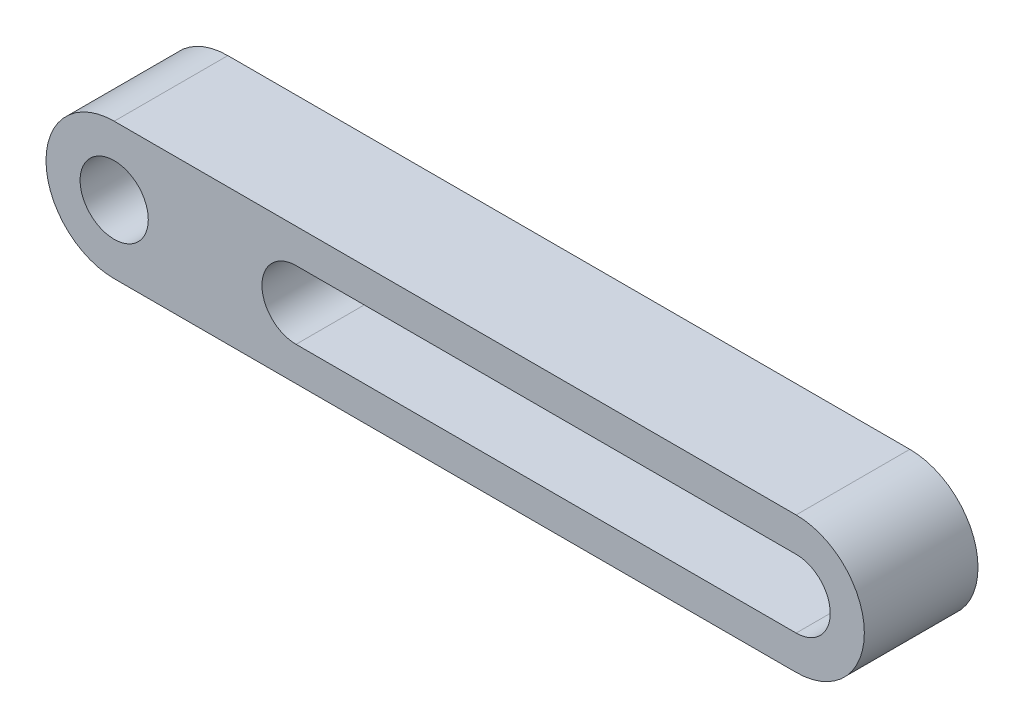
ISO-10303-21;
HEADER;
FILE_DESCRIPTION(('STEP AP214'),'2;1');
FILE_NAME('part.step','',(''),(''),'','','');
FILE_SCHEMA(('AUTOMOTIVE_DESIGN { 1 0 10303 214 1 1 1 1 }'));
ENDSEC;
DATA;
#1=APPLICATION_CONTEXT('core data for automotive mechanical design processes');
#2=APPLICATION_PROTOCOL_DEFINITION('international standard','automotive_design',2000,#1);
#3=PRODUCT_CONTEXT('',#1,'mechanical');
#4=PRODUCT('Part','Part','',(#3));
#5=PRODUCT_RELATED_PRODUCT_CATEGORY('part','',(#4));
#6=PRODUCT_DEFINITION_FORMATION('','',#4);
#7=PRODUCT_DEFINITION_CONTEXT('part definition',#1,'design');
#8=PRODUCT_DEFINITION('design','',#6,#7);
#9=PRODUCT_DEFINITION_SHAPE('','',#8);
#10=(LENGTH_UNIT() NAMED_UNIT(*) SI_UNIT(.MILLI.,.METRE.));
#11=(NAMED_UNIT(*) PLANE_ANGLE_UNIT() SI_UNIT($,.RADIAN.));
#12=(NAMED_UNIT(*) SI_UNIT($,.STERADIAN.) SOLID_ANGLE_UNIT());
#13=UNCERTAINTY_MEASURE_WITH_UNIT(LENGTH_MEASURE(1.E-05),#10,'distance_accuracy_value','');
#14=(GEOMETRIC_REPRESENTATION_CONTEXT(3) GLOBAL_UNCERTAINTY_ASSIGNED_CONTEXT((#13)) GLOBAL_UNIT_ASSIGNED_CONTEXT((#10,
#11,#12)) REPRESENTATION_CONTEXT('',''));
#15=CARTESIAN_POINT('',(0.,0.,0.));
#16=DIRECTION('',(0.,0.,1.));
#17=DIRECTION('',(1.,0.,0.));
#18=AXIS2_PLACEMENT_3D('',#15,#16,#17);
#19=CARTESIAN_POINT('',(0.,0.,5.));
#20=DIRECTION('',(0.,0.,1.));
#21=DIRECTION('',(1.,0.,0.));
#22=AXIS2_PLACEMENT_3D('',#19,#20,#21);
#23=PLANE('',#22);
#24=CARTESIAN_POINT('',(0.,0.,5.));
#25=DIRECTION('',(0.,0.,1.));
#26=DIRECTION('',(1.,0.,0.));
#27=AXIS2_PLACEMENT_3D('',#24,#25,#26);
#28=CIRCLE('',#27,3.00000000000011);
#29=CARTESIAN_POINT('',(0.,3.00000000000011,5.));
#30=VERTEX_POINT('',#29);
#31=CARTESIAN_POINT('',(0.,-3.00000000000011,5.));
#32=VERTEX_POINT('',#31);
#33=EDGE_CURVE('E150',#30,#32,#28,.T.);
#34=ORIENTED_EDGE('',*,*,#33,.T.);
#35=DIRECTION('',(1.,0.,0.));
#36=VECTOR('',#35,1.);
#37=CARTESIAN_POINT('',(0.,-3.00000000000011,5.));
#38=LINE('',#37,#36);
#39=CARTESIAN_POINT('',(30.,-3.,5.));
#40=VERTEX_POINT('',#39);
#41=EDGE_CURVE('E153',#32,#40,#38,.T.);
#42=ORIENTED_EDGE('',*,*,#41,.T.);
#43=CARTESIAN_POINT('',(30.,0.,5.));
#44=DIRECTION('',(0.,0.,1.));
#45=DIRECTION('',(1.,0.,0.));
#46=AXIS2_PLACEMENT_3D('',#43,#44,#45);
#47=CIRCLE('',#46,3.);
#48=CARTESIAN_POINT('',(30.,3.,5.));
#49=VERTEX_POINT('',#48);
#50=EDGE_CURVE('E156',#40,#49,#47,.T.);
#51=ORIENTED_EDGE('',*,*,#50,.T.);
#52=DIRECTION('',(-1.,0.,0.));
#53=VECTOR('',#52,1.);
#54=CARTESIAN_POINT('',(0.,3.00000000000011,5.));
#55=LINE('',#54,#53);
#56=EDGE_CURVE('E158',#49,#30,#55,.T.);
#57=ORIENTED_EDGE('',*,*,#56,.T.);
#58=EDGE_LOOP('',(#34,#42,#51,#57));
#59=FACE_BOUND('',#58,.T.);
#60=CARTESIAN_POINT('',(0.,0.,5.));
#61=DIRECTION('',(0.,0.,1.));
#62=DIRECTION('',(1.,0.,0.));
#63=AXIS2_PLACEMENT_3D('',#60,#61,#62);
#64=CIRCLE('',#63,1.50000000000006);
#65=CARTESIAN_POINT('',(1.50000000000006,0.,5.));
#66=VERTEX_POINT('',#65);
#67=EDGE_CURVE('E144',#66,#66,#64,.T.);
#68=ORIENTED_EDGE('',*,*,#67,.F.);
#69=EDGE_LOOP('',(#68));
#70=FACE_BOUND('',#69,.T.);
#71=DIRECTION('',(-1.,0.,0.));
#72=VECTOR('',#71,1.);
#73=CARTESIAN_POINT('',(30.,1.5,5.));
#74=LINE('',#73,#72);
#75=CARTESIAN_POINT('',(30.,1.5,5.));
#76=VERTEX_POINT('',#75);
#77=CARTESIAN_POINT('',(8.,1.5,5.));
#78=VERTEX_POINT('',#77);
#79=EDGE_CURVE('E116',#76,#78,#74,.T.);
#80=ORIENTED_EDGE('',*,*,#79,.F.);
#81=CARTESIAN_POINT('',(30.,0.,5.));
#82=DIRECTION('',(0.,0.,1.));
#83=DIRECTION('',(1.,0.,0.));
#84=AXIS2_PLACEMENT_3D('',#81,#82,#83);
#85=CIRCLE('',#84,1.5);
#86=CARTESIAN_POINT('',(30.,-1.5,5.));
#87=VERTEX_POINT('',#86);
#88=EDGE_CURVE('E108',#87,#76,#85,.T.);
#89=ORIENTED_EDGE('',*,*,#88,.F.);
#90=DIRECTION('',(1.,0.,0.));
#91=VECTOR('',#90,1.);
#92=CARTESIAN_POINT('',(30.,-1.5,5.));
#93=LINE('',#92,#91);
#94=CARTESIAN_POINT('',(8.,-1.5,5.));
#95=VERTEX_POINT('',#94);
#96=EDGE_CURVE('E130',#95,#87,#93,.T.);
#97=ORIENTED_EDGE('',*,*,#96,.F.);
#98=CARTESIAN_POINT('',(8.,0.,5.));
#99=DIRECTION('',(0.,0.,1.));
#100=DIRECTION('',(1.,0.,0.));
#101=AXIS2_PLACEMENT_3D('',#98,#99,#100);
#102=CIRCLE('',#101,1.5);
#103=EDGE_CURVE('E128',#78,#95,#102,.T.);
#104=ORIENTED_EDGE('',*,*,#103,.F.);
#105=EDGE_LOOP('',(#80,#89,#97,#104));
#106=FACE_BOUND('',#105,.T.);
#107=ADVANCED_FACE('F43',(#59,#70,#106),#23,.T.);
#108=CARTESIAN_POINT('',(0.,0.,0.));
#109=DIRECTION('',(0.,0.,1.));
#110=DIRECTION('',(1.,0.,0.));
#111=AXIS2_PLACEMENT_3D('',#108,#109,#110);
#112=PLANE('',#111);
#113=CARTESIAN_POINT('',(0.,0.,0.));
#114=DIRECTION('',(0.,0.,1.));
#115=DIRECTION('',(1.,0.,0.));
#116=AXIS2_PLACEMENT_3D('',#113,#114,#115);
#117=CIRCLE('',#116,1.50000000000006);
#118=CARTESIAN_POINT('',(1.50000000000006,0.,0.));
#119=VERTEX_POINT('',#118);
#120=EDGE_CURVE('E124',#119,#119,#117,.T.);
#121=ORIENTED_EDGE('',*,*,#120,.T.);
#122=EDGE_LOOP('',(#121));
#123=FACE_BOUND('',#122,.T.);
#124=CARTESIAN_POINT('',(0.,0.,0.));
#125=DIRECTION('',(0.,0.,1.));
#126=DIRECTION('',(1.,0.,0.));
#127=AXIS2_PLACEMENT_3D('',#124,#125,#126);
#128=CIRCLE('',#127,3.00000000000011);
#129=CARTESIAN_POINT('',(0.,3.00000000000011,0.));
#130=VERTEX_POINT('',#129);
#131=CARTESIAN_POINT('',(0.,-3.00000000000011,0.));
#132=VERTEX_POINT('',#131);
#133=EDGE_CURVE('E147',#130,#132,#128,.T.);
#134=ORIENTED_EDGE('',*,*,#133,.F.);
#135=DIRECTION('',(-1.,0.,0.));
#136=VECTOR('',#135,1.);
#137=CARTESIAN_POINT('',(0.,3.00000000000011,0.));
#138=LINE('',#137,#136);
#139=CARTESIAN_POINT('',(30.,3.,0.));
#140=VERTEX_POINT('',#139);
#141=EDGE_CURVE('E154',#140,#130,#138,.T.);
#142=ORIENTED_EDGE('',*,*,#141,.F.);
#143=CARTESIAN_POINT('',(30.,0.,0.));
#144=DIRECTION('',(0.,0.,1.));
#145=DIRECTION('',(1.,0.,0.));
#146=AXIS2_PLACEMENT_3D('',#143,#144,#145);
#147=CIRCLE('',#146,3.);
#148=CARTESIAN_POINT('',(30.,-3.,0.));
#149=VERTEX_POINT('',#148);
#150=EDGE_CURVE('E165',#149,#140,#147,.T.);
#151=ORIENTED_EDGE('',*,*,#150,.F.);
#152=DIRECTION('',(1.,0.,0.));
#153=VECTOR('',#152,1.);
#154=CARTESIAN_POINT('',(0.,-3.00000000000011,0.));
#155=LINE('',#154,#153);
#156=EDGE_CURVE('E163',#132,#149,#155,.T.);
#157=ORIENTED_EDGE('',*,*,#156,.F.);
#158=EDGE_LOOP('',(#134,#142,#151,#157));
#159=FACE_BOUND('',#158,.T.);
#160=CARTESIAN_POINT('',(30.,0.,0.));
#161=DIRECTION('',(0.,0.,1.));
#162=DIRECTION('',(1.,0.,0.));
#163=AXIS2_PLACEMENT_3D('',#160,#161,#162);
#164=CIRCLE('',#163,1.5);
#165=CARTESIAN_POINT('',(30.,-1.5,0.));
#166=VERTEX_POINT('',#165);
#167=CARTESIAN_POINT('',(30.,1.5,0.));
#168=VERTEX_POINT('',#167);
#169=EDGE_CURVE('E66',#166,#168,#164,.T.);
#170=ORIENTED_EDGE('',*,*,#169,.T.);
#171=DIRECTION('',(-1.,0.,0.));
#172=VECTOR('',#171,1.);
#173=CARTESIAN_POINT('',(30.,1.5,0.));
#174=LINE('',#173,#172);
#175=CARTESIAN_POINT('',(8.,1.5,0.));
#176=VERTEX_POINT('',#175);
#177=EDGE_CURVE('E123',#168,#176,#174,.T.);
#178=ORIENTED_EDGE('',*,*,#177,.T.);
#179=CARTESIAN_POINT('',(8.,0.,0.));
#180=DIRECTION('',(0.,0.,1.));
#181=DIRECTION('',(1.,0.,0.));
#182=AXIS2_PLACEMENT_3D('',#179,#180,#181);
#183=CIRCLE('',#182,1.5);
#184=CARTESIAN_POINT('',(8.,-1.5,0.));
#185=VERTEX_POINT('',#184);
#186=EDGE_CURVE('E136',#176,#185,#183,.T.);
#187=ORIENTED_EDGE('',*,*,#186,.T.);
#188=DIRECTION('',(1.,0.,0.));
#189=VECTOR('',#188,1.);
#190=CARTESIAN_POINT('',(30.,-1.5,0.));
#191=LINE('',#190,#189);
#192=EDGE_CURVE('E117',#185,#166,#191,.T.);
#193=ORIENTED_EDGE('',*,*,#192,.T.);
#194=EDGE_LOOP('',(#170,#178,#187,#193));
#195=FACE_BOUND('',#194,.T.);
#196=ADVANCED_FACE('F183',(#123,#159,#195),#112,.F.);
#197=CARTESIAN_POINT('',(0.,0.,5.));
#198=DIRECTION('',(0.,0.,-1.));
#199=DIRECTION('',(-1.,0.,0.));
#200=AXIS2_PLACEMENT_3D('',#197,#198,#199);
#201=CYLINDRICAL_SURFACE('',#200,3.00000000000011);
#202=ORIENTED_EDGE('',*,*,#133,.T.);
#203=DIRECTION('',(0.,0.,-1.));
#204=VECTOR('',#203,1.);
#205=CARTESIAN_POINT('',(0.,-3.00000000000011,5.));
#206=LINE('',#205,#204);
#207=EDGE_CURVE('E11',#32,#132,#206,.T.);
#208=ORIENTED_EDGE('',*,*,#207,.F.);
#209=ORIENTED_EDGE('',*,*,#33,.F.);
#210=DIRECTION('',(0.,0.,-1.));
#211=VECTOR('',#210,1.);
#212=CARTESIAN_POINT('',(0.,3.00000000000011,5.));
#213=LINE('',#212,#211);
#214=EDGE_CURVE('E160',#30,#130,#213,.T.);
#215=ORIENTED_EDGE('',*,*,#214,.T.);
#216=EDGE_LOOP('',(#202,#208,#209,#215));
#217=FACE_BOUND('',#216,.T.);
#218=ADVANCED_FACE('F45',(#217),#201,.T.);
#219=CARTESIAN_POINT('',(0.,-3.00000000000011,5.));
#220=DIRECTION('',(0.,1.,0.));
#221=DIRECTION('',(-1.,0.,0.));
#222=AXIS2_PLACEMENT_3D('',#219,#220,#221);
#223=PLANE('',#222);
#224=ORIENTED_EDGE('',*,*,#156,.T.);
#225=DIRECTION('',(0.,0.,-1.));
#226=VECTOR('',#225,1.);
#227=CARTESIAN_POINT('',(30.,-3.,5.));
#228=LINE('',#227,#226);
#229=EDGE_CURVE('E51',#40,#149,#228,.T.);
#230=ORIENTED_EDGE('',*,*,#229,.F.);
#231=ORIENTED_EDGE('',*,*,#41,.F.);
#232=ORIENTED_EDGE('',*,*,#207,.T.);
#233=EDGE_LOOP('',(#224,#230,#231,#232));
#234=FACE_BOUND('',#233,.T.);
#235=ADVANCED_FACE('F194',(#234),#223,.F.);
#236=CARTESIAN_POINT('',(30.,0.,5.));
#237=DIRECTION('',(0.,0.,-1.));
#238=DIRECTION('',(-1.,0.,0.));
#239=AXIS2_PLACEMENT_3D('',#236,#237,#238);
#240=CYLINDRICAL_SURFACE('',#239,3.);
#241=ORIENTED_EDGE('',*,*,#150,.T.);
#242=DIRECTION('',(0.,0.,-1.));
#243=VECTOR('',#242,1.);
#244=CARTESIAN_POINT('',(30.,3.,5.));
#245=LINE('',#244,#243);
#246=EDGE_CURVE('E170',#49,#140,#245,.T.);
#247=ORIENTED_EDGE('',*,*,#246,.F.);
#248=ORIENTED_EDGE('',*,*,#50,.F.);
#249=ORIENTED_EDGE('',*,*,#229,.T.);
#250=EDGE_LOOP('',(#241,#247,#248,#249));
#251=FACE_BOUND('',#250,.T.);
#252=ADVANCED_FACE('F177',(#251),#240,.T.);
#253=CARTESIAN_POINT('',(0.,3.00000000000011,5.));
#254=DIRECTION('',(0.,-1.,0.));
#255=DIRECTION('',(1.,0.,0.));
#256=AXIS2_PLACEMENT_3D('',#253,#254,#255);
#257=PLANE('',#256);
#258=ORIENTED_EDGE('',*,*,#141,.T.);
#259=ORIENTED_EDGE('',*,*,#214,.F.);
#260=ORIENTED_EDGE('',*,*,#56,.F.);
#261=ORIENTED_EDGE('',*,*,#246,.T.);
#262=EDGE_LOOP('',(#258,#259,#260,#261));
#263=FACE_BOUND('',#262,.T.);
#264=ADVANCED_FACE('F187',(#263),#257,.F.);
#265=CARTESIAN_POINT('',(0.,0.,5.));
#266=DIRECTION('',(0.,0.,-1.));
#267=DIRECTION('',(-1.,0.,0.));
#268=AXIS2_PLACEMENT_3D('',#265,#266,#267);
#269=CYLINDRICAL_SURFACE('',#268,1.50000000000006);
#270=ORIENTED_EDGE('',*,*,#67,.T.);
#271=EDGE_LOOP('',(#270));
#272=FACE_BOUND('',#271,.T.);
#273=ORIENTED_EDGE('',*,*,#120,.F.);
#274=EDGE_LOOP('',(#273));
#275=FACE_BOUND('',#274,.T.);
#276=ADVANCED_FACE('F208',(#272,#275),#269,.F.);
#277=CARTESIAN_POINT('',(30.,0.,5.));
#278=DIRECTION('',(0.,0.,-1.));
#279=DIRECTION('',(-1.,0.,0.));
#280=AXIS2_PLACEMENT_3D('',#277,#278,#279);
#281=CYLINDRICAL_SURFACE('',#280,1.5);
#282=ORIENTED_EDGE('',*,*,#169,.F.);
#283=DIRECTION('',(0.,0.,-1.));
#284=VECTOR('',#283,1.);
#285=CARTESIAN_POINT('',(30.,-1.5,5.));
#286=LINE('',#285,#284);
#287=EDGE_CURVE('E112',#87,#166,#286,.T.);
#288=ORIENTED_EDGE('',*,*,#287,.F.);
#289=ORIENTED_EDGE('',*,*,#88,.T.);
#290=DIRECTION('',(0.,0.,-1.));
#291=VECTOR('',#290,1.);
#292=CARTESIAN_POINT('',(30.,1.5,5.));
#293=LINE('',#292,#291);
#294=EDGE_CURVE('E111',#76,#168,#293,.T.);
#295=ORIENTED_EDGE('',*,*,#294,.T.);
#296=EDGE_LOOP('',(#282,#288,#289,#295));
#297=FACE_BOUND('',#296,.T.);
#298=ADVANCED_FACE('F110',(#297),#281,.F.);
#299=CARTESIAN_POINT('',(30.,1.5,5.));
#300=DIRECTION('',(0.,-1.,0.));
#301=DIRECTION('',(1.,0.,0.));
#302=AXIS2_PLACEMENT_3D('',#299,#300,#301);
#303=PLANE('',#302);
#304=ORIENTED_EDGE('',*,*,#177,.F.);
#305=ORIENTED_EDGE('',*,*,#294,.F.);
#306=ORIENTED_EDGE('',*,*,#79,.T.);
#307=DIRECTION('',(0.,0.,-1.));
#308=VECTOR('',#307,1.);
#309=CARTESIAN_POINT('',(8.,1.5,5.));
#310=LINE('',#309,#308);
#311=EDGE_CURVE('E125',#78,#176,#310,.T.);
#312=ORIENTED_EDGE('',*,*,#311,.T.);
#313=EDGE_LOOP('',(#304,#305,#306,#312));
#314=FACE_BOUND('',#313,.T.);
#315=ADVANCED_FACE('F120',(#314),#303,.T.);
#316=CARTESIAN_POINT('',(8.,0.,5.));
#317=DIRECTION('',(0.,0.,-1.));
#318=DIRECTION('',(-1.,0.,0.));
#319=AXIS2_PLACEMENT_3D('',#316,#317,#318);
#320=CYLINDRICAL_SURFACE('',#319,1.5);
#321=ORIENTED_EDGE('',*,*,#186,.F.);
#322=ORIENTED_EDGE('',*,*,#311,.F.);
#323=ORIENTED_EDGE('',*,*,#103,.T.);
#324=DIRECTION('',(0.,0.,-1.));
#325=VECTOR('',#324,1.);
#326=CARTESIAN_POINT('',(8.,-1.5,5.));
#327=LINE('',#326,#325);
#328=EDGE_CURVE('E58',#95,#185,#327,.T.);
#329=ORIENTED_EDGE('',*,*,#328,.T.);
#330=EDGE_LOOP('',(#321,#322,#323,#329));
#331=FACE_BOUND('',#330,.T.);
#332=ADVANCED_FACE('F222',(#331),#320,.F.);
#333=CARTESIAN_POINT('',(30.,-1.5,5.));
#334=DIRECTION('',(0.,1.,0.));
#335=DIRECTION('',(-1.,0.,0.));
#336=AXIS2_PLACEMENT_3D('',#333,#334,#335);
#337=PLANE('',#336);
#338=ORIENTED_EDGE('',*,*,#192,.F.);
#339=ORIENTED_EDGE('',*,*,#328,.F.);
#340=ORIENTED_EDGE('',*,*,#96,.T.);
#341=ORIENTED_EDGE('',*,*,#287,.T.);
#342=EDGE_LOOP('',(#338,#339,#340,#341));
#343=FACE_BOUND('',#342,.T.);
#344=ADVANCED_FACE('F227',(#343),#337,.T.);
#345=CLOSED_SHELL('',(#107,#196,#218,#235,#252,#264,#276,#298,#315,#332,#344));
#346=MANIFOLD_SOLID_BREP('B2',#345);
#347=ADVANCED_BREP_SHAPE_REPRESENTATION('',(#18,#346),#14);
#348=SHAPE_DEFINITION_REPRESENTATION(#9,#347);
ENDSEC;
END-ISO-10303-21;
